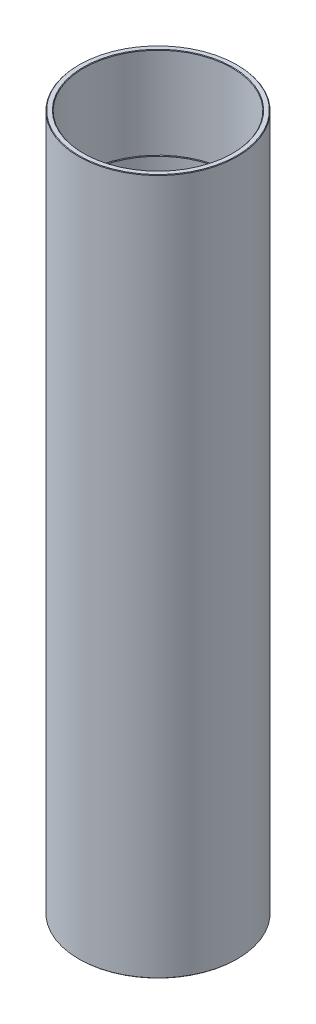
ISO-10303-21;
HEADER;
FILE_DESCRIPTION(('STEP AP214'),'2;1');
FILE_NAME('part.step','',(''),(''),'','','');
FILE_SCHEMA(('AUTOMOTIVE_DESIGN { 1 0 10303 214 1 1 1 1 }'));
ENDSEC;
DATA;
#1=APPLICATION_CONTEXT('core data for automotive mechanical design processes');
#2=APPLICATION_PROTOCOL_DEFINITION('international standard','automotive_design',2000,#1);
#3=PRODUCT_CONTEXT('',#1,'mechanical');
#4=PRODUCT('Part','Part','',(#3));
#5=PRODUCT_RELATED_PRODUCT_CATEGORY('part','',(#4));
#6=PRODUCT_DEFINITION_FORMATION('','',#4);
#7=PRODUCT_DEFINITION_CONTEXT('part definition',#1,'design');
#8=PRODUCT_DEFINITION('design','',#6,#7);
#9=PRODUCT_DEFINITION_SHAPE('','',#8);
#10=(LENGTH_UNIT() NAMED_UNIT(*) SI_UNIT(.MILLI.,.METRE.));
#11=(NAMED_UNIT(*) PLANE_ANGLE_UNIT() SI_UNIT($,.RADIAN.));
#12=(NAMED_UNIT(*) SI_UNIT($,.STERADIAN.) SOLID_ANGLE_UNIT());
#13=UNCERTAINTY_MEASURE_WITH_UNIT(LENGTH_MEASURE(1.E-05),#10,'distance_accuracy_value','');
#14=(GEOMETRIC_REPRESENTATION_CONTEXT(3) GLOBAL_UNCERTAINTY_ASSIGNED_CONTEXT((#13)) GLOBAL_UNIT_ASSIGNED_CONTEXT((#10,
#11,#12)) REPRESENTATION_CONTEXT('',''));
#15=CARTESIAN_POINT('',(0.,0.,0.));
#16=DIRECTION('',(0.,0.,1.));
#17=DIRECTION('',(1.,0.,0.));
#18=AXIS2_PLACEMENT_3D('',#15,#16,#17);
#19=CARTESIAN_POINT('',(-30.2,0.,0.));
#20=DIRECTION('',(0.,1.,0.));
#21=DIRECTION('',(0.,0.,1.));
#22=AXIS2_PLACEMENT_3D('',#19,#20,#21);
#23=PLANE('',#22);
#24=CARTESIAN_POINT('',(0.,0.,0.));
#25=DIRECTION('',(0.,1.,0.));
#26=DIRECTION('',(0.,0.,1.));
#27=AXIS2_PLACEMENT_3D('',#24,#25,#26);
#28=CIRCLE('',#27,28.4500000000001);
#29=CARTESIAN_POINT('',(0.,0.,28.4500000000001));
#30=VERTEX_POINT('',#29);
#31=EDGE_CURVE('E10',#30,#30,#28,.T.);
#32=ORIENTED_EDGE('',*,*,#31,.T.);
#33=EDGE_LOOP('',(#32));
#34=FACE_BOUND('',#33,.T.);
#35=CARTESIAN_POINT('',(0.,0.,0.));
#36=DIRECTION('',(0.,1.,0.));
#37=DIRECTION('',(0.,0.,1.));
#38=AXIS2_PLACEMENT_3D('',#35,#36,#37);
#39=CIRCLE('',#38,29.9999999999999);
#40=CARTESIAN_POINT('',(0.,0.,29.9999999999999));
#41=VERTEX_POINT('',#40);
#42=EDGE_CURVE('E47',#41,#41,#39,.F.);
#43=ORIENTED_EDGE('',*,*,#42,.T.);
#44=EDGE_LOOP('',(#43));
#45=FACE_BOUND('',#44,.T.);
#46=ADVANCED_FACE('F32',(#34,#45),#23,.F.);
#47=CARTESIAN_POINT('',(0.,0.,0.));
#48=DIRECTION('',(0.,-1.,0.));
#49=DIRECTION('',(0.,0.,-1.));
#50=AXIS2_PLACEMENT_3D('',#47,#48,#49);
#51=CYLINDRICAL_SURFACE('',#50,28.25);
#52=CARTESIAN_POINT('',(0.,0.200000000000044,0.));
#53=DIRECTION('',(0.,1.,0.));
#54=DIRECTION('',(0.,0.,1.));
#55=AXIS2_PLACEMENT_3D('',#52,#53,#54);
#56=CIRCLE('',#55,28.25);
#57=CARTESIAN_POINT('',(0.,0.200000000000044,28.25));
#58=VERTEX_POINT('',#57);
#59=EDGE_CURVE('E39',#58,#58,#56,.F.);
#60=ORIENTED_EDGE('',*,*,#59,.T.);
#61=EDGE_LOOP('',(#60));
#62=FACE_BOUND('',#61,.T.);
#63=CARTESIAN_POINT('',(0.,25.,0.));
#64=DIRECTION('',(0.,-1.,0.));
#65=DIRECTION('',(0.,0.,-1.));
#66=AXIS2_PLACEMENT_3D('',#63,#64,#65);
#67=CIRCLE('',#66,28.25);
#68=CARTESIAN_POINT('',(0.,25.,-28.25));
#69=VERTEX_POINT('',#68);
#70=EDGE_CURVE('E70',#69,#69,#67,.T.);
#71=ORIENTED_EDGE('',*,*,#70,.F.);
#72=EDGE_LOOP('',(#71));
#73=FACE_BOUND('',#72,.T.);
#74=ADVANCED_FACE('F91',(#62,#73),#51,.F.);
#75=CARTESIAN_POINT('',(-28.25,25.,0.));
#76=DIRECTION('',(0.,1.,0.));
#77=DIRECTION('',(0.,0.,1.));
#78=AXIS2_PLACEMENT_3D('',#75,#76,#77);
#79=PLANE('',#78);
#80=CARTESIAN_POINT('',(0.,25.,0.));
#81=DIRECTION('',(0.,-1.,0.));
#82=DIRECTION('',(0.,0.,-1.));
#83=AXIS2_PLACEMENT_3D('',#80,#81,#82);
#84=CIRCLE('',#83,28.);
#85=CARTESIAN_POINT('',(0.,25.,-28.));
#86=VERTEX_POINT('',#85);
#87=EDGE_CURVE('E73',#86,#86,#84,.T.);
#88=ORIENTED_EDGE('',*,*,#87,.F.);
#89=EDGE_LOOP('',(#88));
#90=FACE_BOUND('',#89,.T.);
#91=ORIENTED_EDGE('',*,*,#70,.T.);
#92=EDGE_LOOP('',(#91));
#93=FACE_BOUND('',#92,.T.);
#94=ADVANCED_FACE('F85',(#90,#93),#79,.F.);
#95=CARTESIAN_POINT('',(0.,0.,0.));
#96=DIRECTION('',(0.,-1.,0.));
#97=DIRECTION('',(0.,0.,-1.));
#98=AXIS2_PLACEMENT_3D('',#95,#96,#97);
#99=CYLINDRICAL_SURFACE('',#98,28.);
#100=CARTESIAN_POINT('',(0.,229.999961118478,0.));
#101=DIRECTION('',(0.,-1.,0.));
#102=DIRECTION('',(0.,0.,-1.));
#103=AXIS2_PLACEMENT_3D('',#100,#101,#102);
#104=CIRCLE('',#103,28.);
#105=CARTESIAN_POINT('',(0.,229.999961118478,-28.));
#106=VERTEX_POINT('',#105);
#107=EDGE_CURVE('E76',#106,#106,#104,.T.);
#108=ORIENTED_EDGE('',*,*,#107,.F.);
#109=EDGE_LOOP('',(#108));
#110=FACE_BOUND('',#109,.T.);
#111=ORIENTED_EDGE('',*,*,#87,.T.);
#112=EDGE_LOOP('',(#111));
#113=FACE_BOUND('',#112,.T.);
#114=ADVANCED_FACE('F82',(#110,#113),#99,.F.);
#115=CARTESIAN_POINT('',(-28.25,229.999961118478,0.));
#116=DIRECTION('',(0.,-1.,0.));
#117=DIRECTION('',(0.,0.,-1.));
#118=AXIS2_PLACEMENT_3D('',#115,#116,#117);
#119=PLANE('',#118);
#120=CARTESIAN_POINT('',(0.,229.999961118478,0.));
#121=DIRECTION('',(0.,-1.,0.));
#122=DIRECTION('',(0.,0.,-1.));
#123=AXIS2_PLACEMENT_3D('',#120,#121,#122);
#124=CIRCLE('',#123,28.05);
#125=CARTESIAN_POINT('',(0.,229.999961118478,-28.05));
#126=VERTEX_POINT('',#125);
#127=EDGE_CURVE('E55',#126,#126,#124,.F.);
#128=ORIENTED_EDGE('',*,*,#127,.T.);
#129=EDGE_LOOP('',(#128));
#130=FACE_BOUND('',#129,.T.);
#131=ORIENTED_EDGE('',*,*,#107,.T.);
#132=EDGE_LOOP('',(#131));
#133=FACE_BOUND('',#132,.T.);
#134=ADVANCED_FACE('F80',(#130,#133),#119,.F.);
#135=CARTESIAN_POINT('',(0.,0.,0.));
#136=DIRECTION('',(0.,-1.,0.));
#137=DIRECTION('',(0.,0.,-1.));
#138=AXIS2_PLACEMENT_3D('',#135,#136,#137);
#139=CYLINDRICAL_SURFACE('',#138,28.25);
#140=CARTESIAN_POINT('',(0.,230.199961118478,0.));
#141=DIRECTION('',(0.,-1.,0.));
#142=DIRECTION('',(0.,0.,-1.));
#143=AXIS2_PLACEMENT_3D('',#140,#141,#142);
#144=CIRCLE('',#143,28.25);
#145=CARTESIAN_POINT('',(0.,230.199961118478,-28.25));
#146=VERTEX_POINT('',#145);
#147=EDGE_CURVE('E58',#146,#146,#144,.T.);
#148=ORIENTED_EDGE('',*,*,#147,.T.);
#149=EDGE_LOOP('',(#148));
#150=FACE_BOUND('',#149,.T.);
#151=CARTESIAN_POINT('',(0.,264.799961118478,0.));
#152=DIRECTION('',(0.,-1.,0.));
#153=DIRECTION('',(0.,0.,-1.));
#154=AXIS2_PLACEMENT_3D('',#151,#152,#153);
#155=CIRCLE('',#154,28.25);
#156=CARTESIAN_POINT('',(0.,264.799961118478,-28.25));
#157=VERTEX_POINT('',#156);
#158=EDGE_CURVE('E61',#157,#157,#155,.F.);
#159=ORIENTED_EDGE('',*,*,#158,.T.);
#160=EDGE_LOOP('',(#159));
#161=FACE_BOUND('',#160,.T.);
#162=ADVANCED_FACE('F135',(#150,#161),#139,.F.);
#163=CARTESIAN_POINT('',(-30.2,264.999961118478,0.));
#164=DIRECTION('',(0.,-1.,0.));
#165=DIRECTION('',(0.,0.,-1.));
#166=AXIS2_PLACEMENT_3D('',#163,#164,#165);
#167=PLANE('',#166);
#168=CARTESIAN_POINT('',(0.,264.999961118478,0.));
#169=DIRECTION('',(0.,-1.,0.));
#170=DIRECTION('',(0.,0.,-1.));
#171=AXIS2_PLACEMENT_3D('',#168,#169,#170);
#172=CIRCLE('',#171,28.45);
#173=CARTESIAN_POINT('',(0.,264.999961118478,-28.45));
#174=VERTEX_POINT('',#173);
#175=EDGE_CURVE('E52',#174,#174,#172,.T.);
#176=ORIENTED_EDGE('',*,*,#175,.T.);
#177=EDGE_LOOP('',(#176));
#178=FACE_BOUND('',#177,.T.);
#179=CARTESIAN_POINT('',(0.,264.999961118478,0.));
#180=DIRECTION('',(0.,-1.,0.));
#181=DIRECTION('',(0.,0.,-1.));
#182=AXIS2_PLACEMENT_3D('',#179,#180,#181);
#183=CIRCLE('',#182,30.);
#184=CARTESIAN_POINT('',(0.,264.999961118478,-30.));
#185=VERTEX_POINT('',#184);
#186=EDGE_CURVE('E64',#185,#185,#183,.F.);
#187=ORIENTED_EDGE('',*,*,#186,.T.);
#188=EDGE_LOOP('',(#187));
#189=FACE_BOUND('',#188,.T.);
#190=ADVANCED_FACE('F128',(#178,#189),#167,.F.);
#191=CARTESIAN_POINT('',(0.,0.,0.));
#192=DIRECTION('',(0.,-1.,0.));
#193=DIRECTION('',(0.,0.,-1.));
#194=AXIS2_PLACEMENT_3D('',#191,#192,#193);
#195=CYLINDRICAL_SURFACE('',#194,30.2);
#196=CARTESIAN_POINT('',(0.,0.200000000000033,0.));
#197=DIRECTION('',(0.,1.,0.));
#198=DIRECTION('',(0.,0.,1.));
#199=AXIS2_PLACEMENT_3D('',#196,#197,#198);
#200=CIRCLE('',#199,30.2);
#201=CARTESIAN_POINT('',(0.,0.200000000000033,30.2));
#202=VERTEX_POINT('',#201);
#203=EDGE_CURVE('E43',#202,#202,#200,.T.);
#204=ORIENTED_EDGE('',*,*,#203,.T.);
#205=EDGE_LOOP('',(#204));
#206=FACE_BOUND('',#205,.T.);
#207=CARTESIAN_POINT('',(0.,264.799961118478,0.));
#208=DIRECTION('',(0.,-1.,0.));
#209=DIRECTION('',(0.,0.,-1.));
#210=AXIS2_PLACEMENT_3D('',#207,#208,#209);
#211=CIRCLE('',#210,30.2);
#212=CARTESIAN_POINT('',(0.,264.799961118478,-30.2));
#213=VERTEX_POINT('',#212);
#214=EDGE_CURVE('E67',#213,#213,#211,.T.);
#215=ORIENTED_EDGE('',*,*,#214,.T.);
#216=EDGE_LOOP('',(#215));
#217=FACE_BOUND('',#216,.T.);
#218=ADVANCED_FACE('F106',(#206,#217),#195,.T.);
#219=CARTESIAN_POINT('',(0.,264.799961118478,0.));
#220=DIRECTION('',(0.,-1.,0.));
#221=DIRECTION('',(0.,0.,-1.));
#222=AXIS2_PLACEMENT_3D('',#219,#220,#221);
#223=CONICAL_SURFACE('',#222,30.2,0.785398163397362);
#224=ORIENTED_EDGE('',*,*,#186,.F.);
#225=EDGE_LOOP('',(#224));
#226=FACE_BOUND('',#225,.T.);
#227=ORIENTED_EDGE('',*,*,#214,.F.);
#228=EDGE_LOOP('',(#227));
#229=FACE_BOUND('',#228,.T.);
#230=ADVANCED_FACE('F102',(#226,#229),#223,.T.);
#231=CARTESIAN_POINT('',(0.,230.199961118478,0.));
#232=DIRECTION('',(0.,1.,0.));
#233=DIRECTION('',(0.,0.,1.));
#234=AXIS2_PLACEMENT_3D('',#231,#232,#233);
#235=CONICAL_SURFACE('',#234,28.25,0.78539816339744);
#236=ORIENTED_EDGE('',*,*,#127,.F.);
#237=EDGE_LOOP('',(#236));
#238=FACE_BOUND('',#237,.T.);
#239=ORIENTED_EDGE('',*,*,#147,.F.);
#240=EDGE_LOOP('',(#239));
#241=FACE_BOUND('',#240,.T.);
#242=ADVANCED_FACE('F105',(#238,#241),#235,.F.);
#243=CARTESIAN_POINT('',(0.,264.999961118478,0.));
#244=DIRECTION('',(0.,1.,0.));
#245=DIRECTION('',(0.,0.,1.));
#246=AXIS2_PLACEMENT_3D('',#243,#244,#245);
#247=CONICAL_SURFACE('',#246,28.45,0.785398163397509);
#248=ORIENTED_EDGE('',*,*,#158,.F.);
#249=EDGE_LOOP('',(#248));
#250=FACE_BOUND('',#249,.T.);
#251=ORIENTED_EDGE('',*,*,#175,.F.);
#252=EDGE_LOOP('',(#251));
#253=FACE_BOUND('',#252,.T.);
#254=ADVANCED_FACE('F110',(#250,#253),#247,.F.);
#255=CARTESIAN_POINT('',(0.,0.,0.));
#256=DIRECTION('',(0.,1.,0.));
#257=DIRECTION('',(0.,0.,1.));
#258=AXIS2_PLACEMENT_3D('',#255,#256,#257);
#259=CONICAL_SURFACE('',#258,29.9999999999999,0.7853981633975);
#260=ORIENTED_EDGE('',*,*,#203,.F.);
#261=EDGE_LOOP('',(#260));
#262=FACE_BOUND('',#261,.T.);
#263=ORIENTED_EDGE('',*,*,#42,.F.);
#264=EDGE_LOOP('',(#263));
#265=FACE_BOUND('',#264,.T.);
#266=ADVANCED_FACE('F113',(#262,#265),#259,.T.);
#267=CARTESIAN_POINT('',(0.,0.200000000000044,0.));
#268=DIRECTION('',(0.,-1.,0.));
#269=DIRECTION('',(0.,0.,-1.));
#270=AXIS2_PLACEMENT_3D('',#267,#268,#269);
#271=CONICAL_SURFACE('',#270,28.25,0.785398163397483);
#272=ORIENTED_EDGE('',*,*,#31,.F.);
#273=EDGE_LOOP('',(#272));
#274=FACE_BOUND('',#273,.T.);
#275=ORIENTED_EDGE('',*,*,#59,.F.);
#276=EDGE_LOOP('',(#275));
#277=FACE_BOUND('',#276,.T.);
#278=ADVANCED_FACE('F34',(#274,#277),#271,.F.);
#279=CLOSED_SHELL('',(#46,#74,#94,#114,#134,#162,#190,#218,#230,#242,#254,#266,#278));
#280=MANIFOLD_SOLID_BREP('B2',#279);
#281=ADVANCED_BREP_SHAPE_REPRESENTATION('',(#18,#280),#14);
#282=SHAPE_DEFINITION_REPRESENTATION(#9,#281);
ENDSEC;
END-ISO-10303-21;
